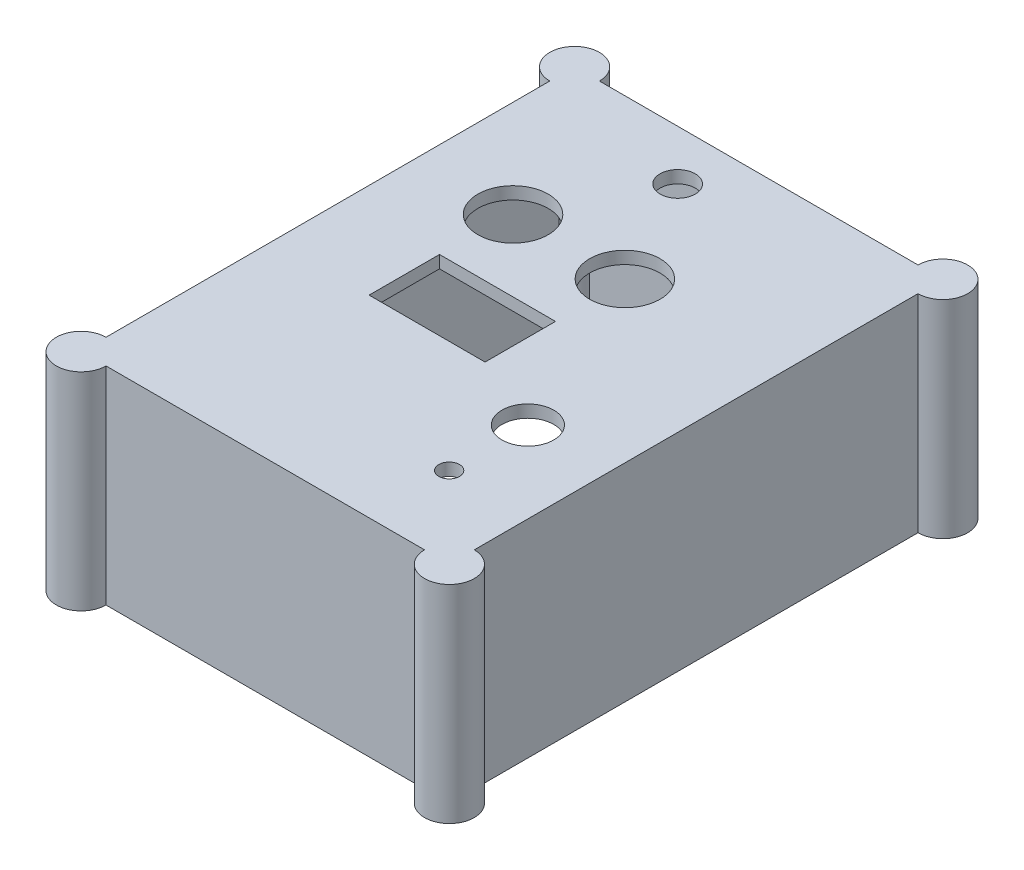
ISO-10303-21;
HEADER;
FILE_DESCRIPTION(('STEP AP214'),'2;1');
FILE_NAME('part.step','',(''),(''),'','','');
FILE_SCHEMA(('AUTOMOTIVE_DESIGN { 1 0 10303 214 1 1 1 1 }'));
ENDSEC;
DATA;
#1=APPLICATION_CONTEXT('core data for automotive mechanical design processes');
#2=APPLICATION_PROTOCOL_DEFINITION('international standard','automotive_design',2000,#1);
#3=PRODUCT_CONTEXT('',#1,'mechanical');
#4=PRODUCT('Part','Part','',(#3));
#5=PRODUCT_RELATED_PRODUCT_CATEGORY('part','',(#4));
#6=PRODUCT_DEFINITION_FORMATION('','',#4);
#7=PRODUCT_DEFINITION_CONTEXT('part definition',#1,'design');
#8=PRODUCT_DEFINITION('design','',#6,#7);
#9=PRODUCT_DEFINITION_SHAPE('','',#8);
#10=(LENGTH_UNIT() NAMED_UNIT(*) SI_UNIT(.MILLI.,.METRE.));
#11=(NAMED_UNIT(*) PLANE_ANGLE_UNIT() SI_UNIT($,.RADIAN.));
#12=(NAMED_UNIT(*) SI_UNIT($,.STERADIAN.) SOLID_ANGLE_UNIT());
#13=UNCERTAINTY_MEASURE_WITH_UNIT(LENGTH_MEASURE(1.E-05),#10,'distance_accuracy_value','');
#14=(GEOMETRIC_REPRESENTATION_CONTEXT(3) GLOBAL_UNCERTAINTY_ASSIGNED_CONTEXT((#13)) GLOBAL_UNIT_ASSIGNED_CONTEXT((#10,
#11,#12)) REPRESENTATION_CONTEXT('',''));
#15=CARTESIAN_POINT('',(0.,0.,0.));
#16=DIRECTION('',(0.,0.,1.));
#17=DIRECTION('',(1.,0.,0.));
#18=AXIS2_PLACEMENT_3D('',#15,#16,#17);
#19=CARTESIAN_POINT('',(0.,3.,0.));
#20=DIRECTION('',(0.,-1.,0.));
#21=DIRECTION('',(0.,0.,-1.));
#22=AXIS2_PLACEMENT_3D('',#19,#20,#21);
#23=PLANE('',#22);
#24=CARTESIAN_POINT('',(5.99999999999999,3.,-21.25));
#25=DIRECTION('',(0.,1.,0.));
#26=DIRECTION('',(0.,0.,-1.));
#27=AXIS2_PLACEMENT_3D('',#24,#25,#26);
#28=CIRCLE('',#27,8.5);
#29=CARTESIAN_POINT('',(5.99999999999999,3.,-29.75));
#30=VERTEX_POINT('',#29);
#31=EDGE_CURVE('E256',#30,#30,#28,.T.);
#32=ORIENTED_EDGE('',*,*,#31,.F.);
#33=EDGE_LOOP('',(#32));
#34=FACE_BOUND('',#33,.T.);
#35=CARTESIAN_POINT('',(-21.,3.,-21.25));
#36=DIRECTION('',(0.,1.,0.));
#37=DIRECTION('',(0.,0.,1.));
#38=AXIS2_PLACEMENT_3D('',#35,#36,#37);
#39=CIRCLE('',#38,8.5);
#40=CARTESIAN_POINT('',(-21.,3.,-12.75));
#41=VERTEX_POINT('',#40);
#42=EDGE_CURVE('E262',#41,#41,#39,.T.);
#43=ORIENTED_EDGE('',*,*,#42,.F.);
#44=EDGE_LOOP('',(#43));
#45=FACE_BOUND('',#44,.T.);
#46=CARTESIAN_POINT('',(-7.50000000000001,3.,-47.5));
#47=DIRECTION('',(0.,1.,0.));
#48=DIRECTION('',(0.,0.,1.));
#49=AXIS2_PLACEMENT_3D('',#46,#47,#48);
#50=CIRCLE('',#49,4.25);
#51=CARTESIAN_POINT('',(-7.50000000000001,3.,-43.25));
#52=VERTEX_POINT('',#51);
#53=EDGE_CURVE('E268',#52,#52,#50,.T.);
#54=ORIENTED_EDGE('',*,*,#53,.F.);
#55=EDGE_LOOP('',(#54));
#56=FACE_BOUND('',#55,.T.);
#57=DIRECTION('',(0.,0.,-1.));
#58=VECTOR('',#57,1.);
#59=CARTESIAN_POINT('',(6.5,3.,13.));
#60=LINE('',#59,#58);
#61=CARTESIAN_POINT('',(6.5,3.,13.));
#62=VERTEX_POINT('',#61);
#63=CARTESIAN_POINT('',(6.50000000000001,3.,-4.00000000000001));
#64=VERTEX_POINT('',#63);
#65=EDGE_CURVE('E225',#62,#64,#60,.T.);
#66=ORIENTED_EDGE('',*,*,#65,.F.);
#67=DIRECTION('',(1.,0.,0.));
#68=VECTOR('',#67,1.);
#69=CARTESIAN_POINT('',(-21.5,3.,13.));
#70=LINE('',#69,#68);
#71=CARTESIAN_POINT('',(-21.5,3.,13.));
#72=VERTEX_POINT('',#71);
#73=EDGE_CURVE('E233',#72,#62,#70,.T.);
#74=ORIENTED_EDGE('',*,*,#73,.F.);
#75=DIRECTION('',(0.,0.,1.));
#76=VECTOR('',#75,1.);
#77=CARTESIAN_POINT('',(-21.5,3.,13.));
#78=LINE('',#77,#76);
#79=CARTESIAN_POINT('',(-21.5,3.,-4.00000000000001));
#80=VERTEX_POINT('',#79);
#81=EDGE_CURVE('E230',#80,#72,#78,.T.);
#82=ORIENTED_EDGE('',*,*,#81,.F.);
#83=DIRECTION('',(-1.,0.,0.));
#84=VECTOR('',#83,1.);
#85=CARTESIAN_POINT('',(-21.5,3.,-4.00000000000001));
#86=LINE('',#85,#84);
#87=EDGE_CURVE('E227',#64,#80,#86,.T.);
#88=ORIENTED_EDGE('',*,*,#87,.F.);
#89=EDGE_LOOP('',(#66,#74,#82,#88));
#90=FACE_BOUND('',#89,.T.);
#91=CARTESIAN_POINT('',(24.8303027798234,3.,21.));
#92=DIRECTION('',(0.,1.,0.));
#93=DIRECTION('',(0.,0.,1.));
#94=AXIS2_PLACEMENT_3D('',#91,#92,#93);
#95=CIRCLE('',#94,6.25);
#96=CARTESIAN_POINT('',(24.8303027798234,3.,27.25));
#97=VERTEX_POINT('',#96);
#98=EDGE_CURVE('E219',#97,#97,#95,.T.);
#99=ORIENTED_EDGE('',*,*,#98,.F.);
#100=EDGE_LOOP('',(#99));
#101=FACE_BOUND('',#100,.T.);
#102=CARTESIAN_POINT('',(24.8303027798234,3.,40.));
#103=DIRECTION('',(0.,1.,0.));
#104=DIRECTION('',(0.,0.,1.));
#105=AXIS2_PLACEMENT_3D('',#102,#103,#104);
#106=CIRCLE('',#105,2.5);
#107=CARTESIAN_POINT('',(24.8303027798234,3.,42.5));
#108=VERTEX_POINT('',#107);
#109=EDGE_CURVE('E200',#108,#108,#106,.T.);
#110=ORIENTED_EDGE('',*,*,#109,.F.);
#111=EDGE_LOOP('',(#110));
#112=FACE_BOUND('',#111,.T.);
#113=DIRECTION('',(0.,0.,1.));
#114=VECTOR('',#113,1.);
#115=CARTESIAN_POINT('',(-44.4588537318775,3.,59.5709641012657));
#116=LINE('',#115,#114);
#117=CARTESIAN_POINT('',(-44.4588537318775,3.,-53.5709641012657));
#118=VERTEX_POINT('',#117);
#119=CARTESIAN_POINT('',(-44.4588537318775,3.,53.5709641012657));
#120=VERTEX_POINT('',#119);
#121=EDGE_CURVE('E211',#118,#120,#116,.T.);
#122=ORIENTED_EDGE('',*,*,#121,.T.);
#123=CARTESIAN_POINT('',(-44.4588537318775,3.,59.5709641012657));
#124=DIRECTION('',(0.,1.,0.));
#125=DIRECTION('',(0.,0.,1.));
#126=AXIS2_PLACEMENT_3D('',#123,#124,#125);
#127=CIRCLE('',#126,6.);
#128=CARTESIAN_POINT('',(-38.4588537318775,3.,59.5709641012657));
#129=VERTEX_POINT('',#128);
#130=EDGE_CURVE('E181',#120,#129,#127,.T.);
#131=ORIENTED_EDGE('',*,*,#130,.T.);
#132=DIRECTION('',(1.,0.,0.));
#133=VECTOR('',#132,1.);
#134=CARTESIAN_POINT('',(-44.4588537318775,3.,59.5709641012657));
#135=LINE('',#134,#133);
#136=CARTESIAN_POINT('',(38.4588537318775,3.,59.5709641012657));
#137=VERTEX_POINT('',#136);
#138=EDGE_CURVE('E189',#129,#137,#135,.T.);
#139=ORIENTED_EDGE('',*,*,#138,.T.);
#140=CARTESIAN_POINT('',(44.4588537318775,3.,59.5709641012657));
#141=DIRECTION('',(0.,1.,0.));
#142=DIRECTION('',(0.,0.,1.));
#143=AXIS2_PLACEMENT_3D('',#140,#141,#142);
#144=CIRCLE('',#143,6.);
#145=CARTESIAN_POINT('',(44.4588537318775,3.,53.5709641012657));
#146=VERTEX_POINT('',#145);
#147=EDGE_CURVE('E190',#137,#146,#144,.T.);
#148=ORIENTED_EDGE('',*,*,#147,.T.);
#149=DIRECTION('',(0.,0.,-1.));
#150=VECTOR('',#149,1.);
#151=CARTESIAN_POINT('',(44.4588537318775,3.,59.5709641012657));
#152=LINE('',#151,#150);
#153=CARTESIAN_POINT('',(44.4588537318775,3.,-53.5709641012657));
#154=VERTEX_POINT('',#153);
#155=EDGE_CURVE('E206',#146,#154,#152,.T.);
#156=ORIENTED_EDGE('',*,*,#155,.T.);
#157=CARTESIAN_POINT('',(44.4588537318775,3.,-59.5709641012657));
#158=DIRECTION('',(0.,1.,0.));
#159=DIRECTION('',(0.,0.,1.));
#160=AXIS2_PLACEMENT_3D('',#157,#158,#159);
#161=CIRCLE('',#160,6.);
#162=CARTESIAN_POINT('',(38.4588537318775,3.,-59.5709641012657));
#163=VERTEX_POINT('',#162);
#164=EDGE_CURVE('E56',#154,#163,#161,.T.);
#165=ORIENTED_EDGE('',*,*,#164,.T.);
#166=DIRECTION('',(-1.,0.,0.));
#167=VECTOR('',#166,1.);
#168=CARTESIAN_POINT('',(-44.4588537318775,3.,-59.5709641012657));
#169=LINE('',#168,#167);
#170=CARTESIAN_POINT('',(-38.4588537318775,3.,-59.5709641012657));
#171=VERTEX_POINT('',#170);
#172=EDGE_CURVE('E208',#163,#171,#169,.T.);
#173=ORIENTED_EDGE('',*,*,#172,.T.);
#174=CARTESIAN_POINT('',(-44.4588537318775,3.,-59.5709641012657));
#175=DIRECTION('',(0.,1.,0.));
#176=DIRECTION('',(0.,0.,1.));
#177=AXIS2_PLACEMENT_3D('',#174,#175,#176);
#178=CIRCLE('',#177,6.);
#179=EDGE_CURVE('E318',#171,#118,#178,.T.);
#180=ORIENTED_EDGE('',*,*,#179,.T.);
#181=EDGE_LOOP('',(#122,#131,#139,#148,#156,#165,#173,#180));
#182=FACE_BOUND('',#181,.T.);
#183=ADVANCED_FACE('F33',(#34,#45,#56,#90,#101,#112,#182),#23,.F.);
#184=CARTESIAN_POINT('',(0.,0.,0.));
#185=DIRECTION('',(0.,-1.,0.));
#186=DIRECTION('',(0.,0.,-1.));
#187=AXIS2_PLACEMENT_3D('',#184,#185,#186);
#188=PLANE('',#187);
#189=CARTESIAN_POINT('',(-44.4588537318775,0.,59.5709641012657));
#190=DIRECTION('',(0.,-1.,0.));
#191=DIRECTION('',(0.,0.,-1.));
#192=AXIS2_PLACEMENT_3D('',#189,#190,#191);
#193=CIRCLE('',#192,6.);
#194=CARTESIAN_POINT('',(-42.5,0.,53.8997303680195));
#195=VERTEX_POINT('',#194);
#196=CARTESIAN_POINT('',(-38.8275920889355,0.,57.5));
#197=VERTEX_POINT('',#196);
#198=EDGE_CURVE('E378',#195,#197,#193,.T.);
#199=ORIENTED_EDGE('',*,*,#198,.F.);
#200=DIRECTION('',(0.,0.,1.));
#201=VECTOR('',#200,1.);
#202=CARTESIAN_POINT('',(-42.5,0.,57.5));
#203=LINE('',#202,#201);
#204=CARTESIAN_POINT('',(-42.5,0.,-53.8997303680195));
#205=VERTEX_POINT('',#204);
#206=EDGE_CURVE('E278',#205,#195,#203,.T.);
#207=ORIENTED_EDGE('',*,*,#206,.F.);
#208=CARTESIAN_POINT('',(-44.4588537318775,0.,-59.5709641012657));
#209=DIRECTION('',(0.,-1.,0.));
#210=DIRECTION('',(0.,0.,-1.));
#211=AXIS2_PLACEMENT_3D('',#208,#209,#210);
#212=CIRCLE('',#211,6.);
#213=CARTESIAN_POINT('',(-38.8275920889355,0.,-57.5));
#214=VERTEX_POINT('',#213);
#215=EDGE_CURVE('E324',#214,#205,#212,.T.);
#216=ORIENTED_EDGE('',*,*,#215,.F.);
#217=DIRECTION('',(-1.,0.,0.));
#218=VECTOR('',#217,1.);
#219=CARTESIAN_POINT('',(-42.5,0.,-57.5));
#220=LINE('',#219,#218);
#221=CARTESIAN_POINT('',(38.8275920889355,0.,-57.5));
#222=VERTEX_POINT('',#221);
#223=EDGE_CURVE('E275',#222,#214,#220,.T.);
#224=ORIENTED_EDGE('',*,*,#223,.F.);
#225=CARTESIAN_POINT('',(44.4588537318775,0.,-59.5709641012657));
#226=DIRECTION('',(0.,-1.,0.));
#227=DIRECTION('',(0.,0.,-1.));
#228=AXIS2_PLACEMENT_3D('',#225,#226,#227);
#229=CIRCLE('',#228,6.);
#230=CARTESIAN_POINT('',(42.5,0.,-53.8997303680195));
#231=VERTEX_POINT('',#230);
#232=EDGE_CURVE('E335',#231,#222,#229,.T.);
#233=ORIENTED_EDGE('',*,*,#232,.F.);
#234=DIRECTION('',(0.,0.,-1.));
#235=VECTOR('',#234,1.);
#236=CARTESIAN_POINT('',(42.5,0.,57.5));
#237=LINE('',#236,#235);
#238=CARTESIAN_POINT('',(42.5,0.,53.8997303680195));
#239=VERTEX_POINT('',#238);
#240=EDGE_CURVE('E271',#239,#231,#237,.T.);
#241=ORIENTED_EDGE('',*,*,#240,.F.);
#242=CARTESIAN_POINT('',(44.4588537318775,0.,59.5709641012657));
#243=DIRECTION('',(0.,-1.,0.));
#244=DIRECTION('',(0.,0.,-1.));
#245=AXIS2_PLACEMENT_3D('',#242,#243,#244);
#246=CIRCLE('',#245,6.);
#247=CARTESIAN_POINT('',(38.8275920889355,0.,57.5));
#248=VERTEX_POINT('',#247);
#249=EDGE_CURVE('E299',#248,#239,#246,.T.);
#250=ORIENTED_EDGE('',*,*,#249,.F.);
#251=DIRECTION('',(1.,0.,0.));
#252=VECTOR('',#251,1.);
#253=CARTESIAN_POINT('',(-42.5,0.,57.5));
#254=LINE('',#253,#252);
#255=EDGE_CURVE('E281',#197,#248,#254,.T.);
#256=ORIENTED_EDGE('',*,*,#255,.F.);
#257=EDGE_LOOP('',(#199,#207,#216,#224,#233,#241,#250,#256));
#258=FACE_BOUND('',#257,.T.);
#259=CARTESIAN_POINT('',(24.8303027798234,0.,21.));
#260=DIRECTION('',(0.,1.,0.));
#261=DIRECTION('',(0.,0.,1.));
#262=AXIS2_PLACEMENT_3D('',#259,#260,#261);
#263=CIRCLE('',#262,6.25);
#264=CARTESIAN_POINT('',(24.8303027798234,0.,27.25));
#265=VERTEX_POINT('',#264);
#266=EDGE_CURVE('E217',#265,#265,#263,.T.);
#267=ORIENTED_EDGE('',*,*,#266,.T.);
#268=EDGE_LOOP('',(#267));
#269=FACE_BOUND('',#268,.T.);
#270=CARTESIAN_POINT('',(-21.,0.,-21.25));
#271=DIRECTION('',(0.,1.,0.));
#272=DIRECTION('',(0.,0.,1.));
#273=AXIS2_PLACEMENT_3D('',#270,#271,#272);
#274=CIRCLE('',#273,8.5);
#275=CARTESIAN_POINT('',(-21.,0.,-12.75));
#276=VERTEX_POINT('',#275);
#277=EDGE_CURVE('E259',#276,#276,#274,.T.);
#278=ORIENTED_EDGE('',*,*,#277,.T.);
#279=EDGE_LOOP('',(#278));
#280=FACE_BOUND('',#279,.T.);
#281=CARTESIAN_POINT('',(-7.50000000000001,0.,-47.5));
#282=DIRECTION('',(0.,1.,0.));
#283=DIRECTION('',(0.,0.,1.));
#284=AXIS2_PLACEMENT_3D('',#281,#282,#283);
#285=CIRCLE('',#284,4.25);
#286=CARTESIAN_POINT('',(-7.50000000000001,0.,-43.25));
#287=VERTEX_POINT('',#286);
#288=EDGE_CURVE('E265',#287,#287,#285,.T.);
#289=ORIENTED_EDGE('',*,*,#288,.T.);
#290=EDGE_LOOP('',(#289));
#291=FACE_BOUND('',#290,.T.);
#292=CARTESIAN_POINT('',(5.99999999999999,0.,-21.25));
#293=DIRECTION('',(0.,1.,0.));
#294=DIRECTION('',(0.,0.,-1.));
#295=AXIS2_PLACEMENT_3D('',#292,#293,#294);
#296=CIRCLE('',#295,8.5);
#297=CARTESIAN_POINT('',(5.99999999999999,0.,-29.75));
#298=VERTEX_POINT('',#297);
#299=EDGE_CURVE('E255',#298,#298,#296,.T.);
#300=ORIENTED_EDGE('',*,*,#299,.T.);
#301=EDGE_LOOP('',(#300));
#302=FACE_BOUND('',#301,.T.);
#303=DIRECTION('',(1.,0.,0.));
#304=VECTOR('',#303,1.);
#305=CARTESIAN_POINT('',(-21.5,0.,13.));
#306=LINE('',#305,#304);
#307=CARTESIAN_POINT('',(-21.5,0.,13.));
#308=VERTEX_POINT('',#307);
#309=CARTESIAN_POINT('',(6.5,0.,13.));
#310=VERTEX_POINT('',#309);
#311=EDGE_CURVE('E228',#308,#310,#306,.T.);
#312=ORIENTED_EDGE('',*,*,#311,.T.);
#313=DIRECTION('',(0.,0.,-1.));
#314=VECTOR('',#313,1.);
#315=CARTESIAN_POINT('',(6.5,0.,13.));
#316=LINE('',#315,#314);
#317=CARTESIAN_POINT('',(6.50000000000001,0.,-4.00000000000001));
#318=VERTEX_POINT('',#317);
#319=EDGE_CURVE('E222',#310,#318,#316,.T.);
#320=ORIENTED_EDGE('',*,*,#319,.T.);
#321=DIRECTION('',(-1.,0.,0.));
#322=VECTOR('',#321,1.);
#323=CARTESIAN_POINT('',(-21.5,0.,-4.00000000000001));
#324=LINE('',#323,#322);
#325=CARTESIAN_POINT('',(-21.5,0.,-4.00000000000001));
#326=VERTEX_POINT('',#325);
#327=EDGE_CURVE('E238',#318,#326,#324,.T.);
#328=ORIENTED_EDGE('',*,*,#327,.T.);
#329=DIRECTION('',(0.,0.,1.));
#330=VECTOR('',#329,1.);
#331=CARTESIAN_POINT('',(-21.5,0.,13.));
#332=LINE('',#331,#330);
#333=EDGE_CURVE('E241',#326,#308,#332,.T.);
#334=ORIENTED_EDGE('',*,*,#333,.T.);
#335=EDGE_LOOP('',(#312,#320,#328,#334));
#336=FACE_BOUND('',#335,.T.);
#337=CARTESIAN_POINT('',(24.8303027798234,0.,40.));
#338=DIRECTION('',(0.,1.,0.));
#339=DIRECTION('',(0.,0.,1.));
#340=AXIS2_PLACEMENT_3D('',#337,#338,#339);
#341=CIRCLE('',#340,2.5);
#342=CARTESIAN_POINT('',(24.8303027798234,0.,42.5));
#343=VERTEX_POINT('',#342);
#344=EDGE_CURVE('E196',#343,#343,#341,.T.);
#345=ORIENTED_EDGE('',*,*,#344,.T.);
#346=EDGE_LOOP('',(#345));
#347=FACE_BOUND('',#346,.T.);
#348=ADVANCED_FACE('F35',(#258,#269,#280,#291,#302,#336,#347),#188,.T.);
#349=CARTESIAN_POINT('',(-7.50000000000001,3.,-47.5));
#350=DIRECTION('',(0.,-1.,0.));
#351=DIRECTION('',(0.,0.,-1.));
#352=AXIS2_PLACEMENT_3D('',#349,#350,#351);
#353=CYLINDRICAL_SURFACE('',#352,4.25);
#354=ORIENTED_EDGE('',*,*,#53,.T.);
#355=EDGE_LOOP('',(#354));
#356=FACE_BOUND('',#355,.T.);
#357=ORIENTED_EDGE('',*,*,#288,.F.);
#358=EDGE_LOOP('',(#357));
#359=FACE_BOUND('',#358,.T.);
#360=ADVANCED_FACE('F408',(#356,#359),#353,.F.);
#361=CARTESIAN_POINT('',(-21.,3.,-21.25));
#362=DIRECTION('',(0.,-1.,0.));
#363=DIRECTION('',(0.,0.,-1.));
#364=AXIS2_PLACEMENT_3D('',#361,#362,#363);
#365=CYLINDRICAL_SURFACE('',#364,8.5);
#366=ORIENTED_EDGE('',*,*,#42,.T.);
#367=EDGE_LOOP('',(#366));
#368=FACE_BOUND('',#367,.T.);
#369=ORIENTED_EDGE('',*,*,#277,.F.);
#370=EDGE_LOOP('',(#369));
#371=FACE_BOUND('',#370,.T.);
#372=ADVANCED_FACE('F414',(#368,#371),#365,.F.);
#373=CARTESIAN_POINT('',(5.99999999999999,3.,-21.25));
#374=DIRECTION('',(0.,-1.,0.));
#375=DIRECTION('',(0.,0.,-1.));
#376=AXIS2_PLACEMENT_3D('',#373,#374,#375);
#377=CYLINDRICAL_SURFACE('',#376,8.5);
#378=ORIENTED_EDGE('',*,*,#31,.T.);
#379=EDGE_LOOP('',(#378));
#380=FACE_BOUND('',#379,.T.);
#381=ORIENTED_EDGE('',*,*,#299,.F.);
#382=EDGE_LOOP('',(#381));
#383=FACE_BOUND('',#382,.T.);
#384=ADVANCED_FACE('F418',(#380,#383),#377,.F.);
#385=CARTESIAN_POINT('',(6.5,3.,13.));
#386=DIRECTION('',(-1.,0.,0.));
#387=DIRECTION('',(0.,0.,1.));
#388=AXIS2_PLACEMENT_3D('',#385,#386,#387);
#389=PLANE('',#388);
#390=ORIENTED_EDGE('',*,*,#319,.F.);
#391=DIRECTION('',(0.,-1.,0.));
#392=VECTOR('',#391,1.);
#393=CARTESIAN_POINT('',(6.5,3.,13.));
#394=LINE('',#393,#392);
#395=EDGE_CURVE('E235',#62,#310,#394,.T.);
#396=ORIENTED_EDGE('',*,*,#395,.F.);
#397=ORIENTED_EDGE('',*,*,#65,.T.);
#398=DIRECTION('',(0.,-1.,0.));
#399=VECTOR('',#398,1.);
#400=CARTESIAN_POINT('',(6.50000000000001,3.,-4.00000000000001));
#401=LINE('',#400,#399);
#402=EDGE_CURVE('E252',#64,#318,#401,.T.);
#403=ORIENTED_EDGE('',*,*,#402,.T.);
#404=EDGE_LOOP('',(#390,#396,#397,#403));
#405=FACE_BOUND('',#404,.T.);
#406=ADVANCED_FACE('F422',(#405),#389,.T.);
#407=CARTESIAN_POINT('',(-21.5,3.,-4.00000000000001));
#408=DIRECTION('',(0.,0.,1.));
#409=DIRECTION('',(1.,0.,0.));
#410=AXIS2_PLACEMENT_3D('',#407,#408,#409);
#411=PLANE('',#410);
#412=ORIENTED_EDGE('',*,*,#327,.F.);
#413=ORIENTED_EDGE('',*,*,#402,.F.);
#414=ORIENTED_EDGE('',*,*,#87,.T.);
#415=DIRECTION('',(0.,-1.,0.));
#416=VECTOR('',#415,1.);
#417=CARTESIAN_POINT('',(-21.5,3.,-4.00000000000001));
#418=LINE('',#417,#416);
#419=EDGE_CURVE('E250',#80,#326,#418,.T.);
#420=ORIENTED_EDGE('',*,*,#419,.T.);
#421=EDGE_LOOP('',(#412,#413,#414,#420));
#422=FACE_BOUND('',#421,.T.);
#423=ADVANCED_FACE('F426',(#422),#411,.T.);
#424=CARTESIAN_POINT('',(-21.5,3.,13.));
#425=DIRECTION('',(1.,0.,0.));
#426=DIRECTION('',(0.,0.,-1.));
#427=AXIS2_PLACEMENT_3D('',#424,#425,#426);
#428=PLANE('',#427);
#429=ORIENTED_EDGE('',*,*,#333,.F.);
#430=ORIENTED_EDGE('',*,*,#419,.F.);
#431=ORIENTED_EDGE('',*,*,#81,.T.);
#432=DIRECTION('',(0.,-1.,0.));
#433=VECTOR('',#432,1.);
#434=CARTESIAN_POINT('',(-21.5,3.,13.));
#435=LINE('',#434,#433);
#436=EDGE_CURVE('E248',#72,#308,#435,.T.);
#437=ORIENTED_EDGE('',*,*,#436,.T.);
#438=EDGE_LOOP('',(#429,#430,#431,#437));
#439=FACE_BOUND('',#438,.T.);
#440=ADVANCED_FACE('F430',(#439),#428,.T.);
#441=CARTESIAN_POINT('',(-21.5,3.,13.));
#442=DIRECTION('',(0.,0.,-1.));
#443=DIRECTION('',(-1.,0.,0.));
#444=AXIS2_PLACEMENT_3D('',#441,#442,#443);
#445=PLANE('',#444);
#446=ORIENTED_EDGE('',*,*,#311,.F.);
#447=ORIENTED_EDGE('',*,*,#436,.F.);
#448=ORIENTED_EDGE('',*,*,#73,.T.);
#449=ORIENTED_EDGE('',*,*,#395,.T.);
#450=EDGE_LOOP('',(#446,#447,#448,#449));
#451=FACE_BOUND('',#450,.T.);
#452=ADVANCED_FACE('F434',(#451),#445,.T.);
#453=CARTESIAN_POINT('',(24.8303027798234,3.,21.));
#454=DIRECTION('',(0.,-1.,0.));
#455=DIRECTION('',(0.,0.,-1.));
#456=AXIS2_PLACEMENT_3D('',#453,#454,#455);
#457=CYLINDRICAL_SURFACE('',#456,6.25);
#458=ORIENTED_EDGE('',*,*,#98,.T.);
#459=EDGE_LOOP('',(#458));
#460=FACE_BOUND('',#459,.T.);
#461=ORIENTED_EDGE('',*,*,#266,.F.);
#462=EDGE_LOOP('',(#461));
#463=FACE_BOUND('',#462,.T.);
#464=ADVANCED_FACE('F438',(#460,#463),#457,.F.);
#465=CARTESIAN_POINT('',(24.8303027798234,3.,40.));
#466=DIRECTION('',(0.,-1.,0.));
#467=DIRECTION('',(0.,0.,-1.));
#468=AXIS2_PLACEMENT_3D('',#465,#466,#467);
#469=CYLINDRICAL_SURFACE('',#468,2.5);
#470=ORIENTED_EDGE('',*,*,#109,.T.);
#471=EDGE_LOOP('',(#470));
#472=FACE_BOUND('',#471,.T.);
#473=ORIENTED_EDGE('',*,*,#344,.F.);
#474=EDGE_LOOP('',(#473));
#475=FACE_BOUND('',#474,.T.);
#476=ADVANCED_FACE('F442',(#472,#475),#469,.F.);
#477=CARTESIAN_POINT('',(44.4588537318775,-47.,59.5709641012657));
#478=DIRECTION('',(1.,0.,0.));
#479=DIRECTION('',(0.,0.,-1.));
#480=AXIS2_PLACEMENT_3D('',#477,#478,#479);
#481=PLANE('',#480);
#482=DIRECTION('',(0.,1.,0.));
#483=VECTOR('',#482,1.);
#484=CARTESIAN_POINT('',(44.4588537318775,-47.,53.5709641012657));
#485=LINE('',#484,#483);
#486=CARTESIAN_POINT('',(44.4588537318775,-47.,53.5709641012657));
#487=VERTEX_POINT('',#486);
#488=EDGE_CURVE('E316',#487,#146,#485,.T.);
#489=ORIENTED_EDGE('',*,*,#488,.F.);
#490=DIRECTION('',(0.,0.,-1.));
#491=VECTOR('',#490,1.);
#492=CARTESIAN_POINT('',(44.4588537318775,-47.,59.5709641012657));
#493=LINE('',#492,#491);
#494=CARTESIAN_POINT('',(44.4588537318775,-47.,-53.5709641012657));
#495=VERTEX_POINT('',#494);
#496=EDGE_CURVE('E215',#487,#495,#493,.T.);
#497=ORIENTED_EDGE('',*,*,#496,.T.);
#498=DIRECTION('',(0.,1.,0.));
#499=VECTOR('',#498,1.);
#500=CARTESIAN_POINT('',(44.4588537318775,-47.,-53.5709641012657));
#501=LINE('',#500,#499);
#502=EDGE_CURVE('E344',#154,#495,#501,.F.);
#503=ORIENTED_EDGE('',*,*,#502,.F.);
#504=ORIENTED_EDGE('',*,*,#155,.F.);
#505=EDGE_LOOP('',(#489,#497,#503,#504));
#506=FACE_BOUND('',#505,.T.);
#507=ADVANCED_FACE('F388',(#506),#481,.T.);
#508=CARTESIAN_POINT('',(-44.4588537318775,-47.,59.5709641012657));
#509=DIRECTION('',(0.,0.,1.));
#510=DIRECTION('',(1.,0.,0.));
#511=AXIS2_PLACEMENT_3D('',#508,#509,#510);
#512=PLANE('',#511);
#513=DIRECTION('',(0.,1.,0.));
#514=VECTOR('',#513,1.);
#515=CARTESIAN_POINT('',(-38.4588537318775,-47.,59.5709641012657));
#516=LINE('',#515,#514);
#517=CARTESIAN_POINT('',(-38.4588537318775,-47.,59.5709641012657));
#518=VERTEX_POINT('',#517);
#519=EDGE_CURVE('E173',#518,#129,#516,.T.);
#520=ORIENTED_EDGE('',*,*,#519,.F.);
#521=DIRECTION('',(1.,0.,0.));
#522=VECTOR('',#521,1.);
#523=CARTESIAN_POINT('',(-44.4588537318775,-47.,59.5709641012657));
#524=LINE('',#523,#522);
#525=CARTESIAN_POINT('',(38.4588537318775,-47.,59.5709641012657));
#526=VERTEX_POINT('',#525);
#527=EDGE_CURVE('E187',#518,#526,#524,.T.);
#528=ORIENTED_EDGE('',*,*,#527,.T.);
#529=DIRECTION('',(0.,1.,0.));
#530=VECTOR('',#529,1.);
#531=CARTESIAN_POINT('',(38.4588537318775,-47.,59.5709641012657));
#532=LINE('',#531,#530);
#533=EDGE_CURVE('E310',#137,#526,#532,.F.);
#534=ORIENTED_EDGE('',*,*,#533,.F.);
#535=ORIENTED_EDGE('',*,*,#138,.F.);
#536=EDGE_LOOP('',(#520,#528,#534,#535));
#537=FACE_BOUND('',#536,.T.);
#538=ADVANCED_FACE('F185',(#537),#512,.T.);
#539=CARTESIAN_POINT('',(-44.4588537318775,-47.,59.5709641012657));
#540=DIRECTION('',(-1.,0.,0.));
#541=DIRECTION('',(0.,0.,1.));
#542=AXIS2_PLACEMENT_3D('',#539,#540,#541);
#543=PLANE('',#542);
#544=DIRECTION('',(0.,1.,0.));
#545=VECTOR('',#544,1.);
#546=CARTESIAN_POINT('',(-44.4588537318775,-47.,53.5709641012657));
#547=LINE('',#546,#545);
#548=CARTESIAN_POINT('',(-44.4588537318775,-47.,53.5709641012657));
#549=VERTEX_POINT('',#548);
#550=EDGE_CURVE('E176',#120,#549,#547,.F.);
#551=ORIENTED_EDGE('',*,*,#550,.F.);
#552=ORIENTED_EDGE('',*,*,#121,.F.);
#553=DIRECTION('',(0.,1.,0.));
#554=VECTOR('',#553,1.);
#555=CARTESIAN_POINT('',(-44.4588537318775,-47.,-53.5709641012657));
#556=LINE('',#555,#554);
#557=CARTESIAN_POINT('',(-44.4588537318775,-47.,-53.5709641012657));
#558=VERTEX_POINT('',#557);
#559=EDGE_CURVE('E331',#558,#118,#556,.T.);
#560=ORIENTED_EDGE('',*,*,#559,.F.);
#561=DIRECTION('',(0.,0.,1.));
#562=VECTOR('',#561,1.);
#563=CARTESIAN_POINT('',(-44.4588537318775,-47.,59.5709641012657));
#564=LINE('',#563,#562);
#565=EDGE_CURVE('E197',#558,#549,#564,.T.);
#566=ORIENTED_EDGE('',*,*,#565,.T.);
#567=EDGE_LOOP('',(#551,#552,#560,#566));
#568=FACE_BOUND('',#567,.T.);
#569=ADVANCED_FACE('F368',(#568),#543,.T.);
#570=CARTESIAN_POINT('',(-44.4588537318775,-47.,-59.5709641012657));
#571=DIRECTION('',(0.,0.,-1.));
#572=DIRECTION('',(-1.,0.,0.));
#573=AXIS2_PLACEMENT_3D('',#570,#571,#572);
#574=PLANE('',#573);
#575=DIRECTION('',(0.,1.,0.));
#576=VECTOR('',#575,1.);
#577=CARTESIAN_POINT('',(-38.4588537318775,-47.,-59.5709641012657));
#578=LINE('',#577,#576);
#579=CARTESIAN_POINT('',(-38.4588537318775,-47.,-59.5709641012657));
#580=VERTEX_POINT('',#579);
#581=EDGE_CURVE('E329',#171,#580,#578,.F.);
#582=ORIENTED_EDGE('',*,*,#581,.F.);
#583=ORIENTED_EDGE('',*,*,#172,.F.);
#584=DIRECTION('',(0.,1.,0.));
#585=VECTOR('',#584,1.);
#586=CARTESIAN_POINT('',(38.4588537318775,-47.,-59.5709641012657));
#587=LINE('',#586,#585);
#588=CARTESIAN_POINT('',(38.4588537318775,-47.,-59.5709641012657));
#589=VERTEX_POINT('',#588);
#590=EDGE_CURVE('E342',#589,#163,#587,.T.);
#591=ORIENTED_EDGE('',*,*,#590,.F.);
#592=DIRECTION('',(-1.,0.,0.));
#593=VECTOR('',#592,1.);
#594=CARTESIAN_POINT('',(-44.4588537318775,-47.,-59.5709641012657));
#595=LINE('',#594,#593);
#596=EDGE_CURVE('E202',#589,#580,#595,.T.);
#597=ORIENTED_EDGE('',*,*,#596,.T.);
#598=EDGE_LOOP('',(#582,#583,#591,#597));
#599=FACE_BOUND('',#598,.T.);
#600=ADVANCED_FACE('F359',(#599),#574,.T.);
#601=CARTESIAN_POINT('',(0.,-47.,0.));
#602=DIRECTION('',(0.,-1.,0.));
#603=DIRECTION('',(0.,0.,-1.));
#604=AXIS2_PLACEMENT_3D('',#601,#602,#603);
#605=PLANE('',#604);
#606=CARTESIAN_POINT('',(-44.4588537318775,-47.,-59.5709641012657));
#607=DIRECTION('',(0.,-1.,0.));
#608=DIRECTION('',(0.,0.,-1.));
#609=AXIS2_PLACEMENT_3D('',#606,#607,#608);
#610=CIRCLE('',#609,1.6);
#611=CARTESIAN_POINT('',(-44.4588537318775,-47.,-61.1709641012657));
#612=VERTEX_POINT('',#611);
#613=EDGE_CURVE('E608',#612,#612,#610,.T.);
#614=ORIENTED_EDGE('',*,*,#613,.F.);
#615=EDGE_LOOP('',(#614));
#616=FACE_BOUND('',#615,.T.);
#617=CARTESIAN_POINT('',(44.4588537318775,-47.,-59.5709641012657));
#618=DIRECTION('',(0.,-1.,0.));
#619=DIRECTION('',(0.,0.,-1.));
#620=AXIS2_PLACEMENT_3D('',#617,#618,#619);
#621=CIRCLE('',#620,1.6);
#622=CARTESIAN_POINT('',(44.4588537318775,-47.,-61.1709641012657));
#623=VERTEX_POINT('',#622);
#624=EDGE_CURVE('E607',#623,#623,#621,.T.);
#625=ORIENTED_EDGE('',*,*,#624,.F.);
#626=EDGE_LOOP('',(#625));
#627=FACE_BOUND('',#626,.T.);
#628=CARTESIAN_POINT('',(44.4588537318775,-47.,59.5709641012657));
#629=DIRECTION('',(0.,-1.,0.));
#630=DIRECTION('',(0.,0.,-1.));
#631=AXIS2_PLACEMENT_3D('',#628,#629,#630);
#632=CIRCLE('',#631,1.6);
#633=CARTESIAN_POINT('',(44.4588537318775,-47.,57.9709641012657));
#634=VERTEX_POINT('',#633);
#635=EDGE_CURVE('E621',#634,#634,#632,.T.);
#636=ORIENTED_EDGE('',*,*,#635,.F.);
#637=EDGE_LOOP('',(#636));
#638=FACE_BOUND('',#637,.T.);
#639=CARTESIAN_POINT('',(-44.4588537318775,-47.,59.5709641012657));
#640=DIRECTION('',(0.,-1.,0.));
#641=DIRECTION('',(0.,0.,-1.));
#642=AXIS2_PLACEMENT_3D('',#639,#640,#641);
#643=CIRCLE('',#642,1.6);
#644=CARTESIAN_POINT('',(-44.4588537318775,-47.,57.9709641012657));
#645=VERTEX_POINT('',#644);
#646=EDGE_CURVE('E374',#645,#645,#643,.T.);
#647=ORIENTED_EDGE('',*,*,#646,.F.);
#648=EDGE_LOOP('',(#647));
#649=FACE_BOUND('',#648,.T.);
#650=ORIENTED_EDGE('',*,*,#527,.F.);
#651=CARTESIAN_POINT('',(-44.4588537318775,-47.,59.5709641012657));
#652=DIRECTION('',(0.,1.,0.));
#653=DIRECTION('',(0.,0.,1.));
#654=AXIS2_PLACEMENT_3D('',#651,#652,#653);
#655=CIRCLE('',#654,6.);
#656=EDGE_CURVE('E170',#549,#518,#655,.T.);
#657=ORIENTED_EDGE('',*,*,#656,.F.);
#658=ORIENTED_EDGE('',*,*,#565,.F.);
#659=CARTESIAN_POINT('',(-44.4588537318775,-47.,-59.5709641012657));
#660=DIRECTION('',(0.,1.,0.));
#661=DIRECTION('',(0.,0.,1.));
#662=AXIS2_PLACEMENT_3D('',#659,#660,#661);
#663=CIRCLE('',#662,6.);
#664=EDGE_CURVE('E319',#580,#558,#663,.T.);
#665=ORIENTED_EDGE('',*,*,#664,.F.);
#666=ORIENTED_EDGE('',*,*,#596,.F.);
#667=CARTESIAN_POINT('',(44.4588537318775,-47.,-59.5709641012657));
#668=DIRECTION('',(0.,1.,0.));
#669=DIRECTION('',(0.,0.,1.));
#670=AXIS2_PLACEMENT_3D('',#667,#668,#669);
#671=CIRCLE('',#670,6.);
#672=EDGE_CURVE('E333',#495,#589,#671,.T.);
#673=ORIENTED_EDGE('',*,*,#672,.F.);
#674=ORIENTED_EDGE('',*,*,#496,.F.);
#675=CARTESIAN_POINT('',(44.4588537318775,-47.,59.5709641012657));
#676=DIRECTION('',(0.,1.,0.));
#677=DIRECTION('',(0.,0.,1.));
#678=AXIS2_PLACEMENT_3D('',#675,#676,#677);
#679=CIRCLE('',#678,6.);
#680=EDGE_CURVE('E195',#526,#487,#679,.T.);
#681=ORIENTED_EDGE('',*,*,#680,.F.);
#682=EDGE_LOOP('',(#650,#657,#658,#665,#666,#673,#674,#681));
#683=FACE_BOUND('',#682,.T.);
#684=DIRECTION('',(0.,0.,1.));
#685=VECTOR('',#684,1.);
#686=CARTESIAN_POINT('',(-42.5,-47.,57.5));
#687=LINE('',#686,#685);
#688=CARTESIAN_POINT('',(-42.5,-47.,-53.8997303680195));
#689=VERTEX_POINT('',#688);
#690=CARTESIAN_POINT('',(-42.5,-47.,53.8997303680195));
#691=VERTEX_POINT('',#690);
#692=EDGE_CURVE('E347',#689,#691,#687,.T.);
#693=ORIENTED_EDGE('',*,*,#692,.T.);
#694=CARTESIAN_POINT('',(-38.8275920889355,-47.,57.5));
#695=VERTEX_POINT('',#694);
#696=EDGE_CURVE('E48',#695,#691,#655,.T.);
#697=ORIENTED_EDGE('',*,*,#696,.F.);
#698=DIRECTION('',(1.,0.,0.));
#699=VECTOR('',#698,1.);
#700=CARTESIAN_POINT('',(42.5,-47.,57.5));
#701=LINE('',#700,#699);
#702=CARTESIAN_POINT('',(38.8275920889355,-47.,57.5));
#703=VERTEX_POINT('',#702);
#704=EDGE_CURVE('E293',#695,#703,#701,.T.);
#705=ORIENTED_EDGE('',*,*,#704,.T.);
#706=CARTESIAN_POINT('',(42.5,-47.,53.8997303680195));
#707=VERTEX_POINT('',#706);
#708=EDGE_CURVE('E302',#707,#703,#679,.T.);
#709=ORIENTED_EDGE('',*,*,#708,.F.);
#710=DIRECTION('',(0.,0.,-1.));
#711=VECTOR('',#710,1.);
#712=CARTESIAN_POINT('',(42.5,-47.,-57.5));
#713=LINE('',#712,#711);
#714=CARTESIAN_POINT('',(42.5,-47.,-53.8997303680195));
#715=VERTEX_POINT('',#714);
#716=EDGE_CURVE('E350',#707,#715,#713,.T.);
#717=ORIENTED_EDGE('',*,*,#716,.T.);
#718=CARTESIAN_POINT('',(38.8275920889355,-47.,-57.5));
#719=VERTEX_POINT('',#718);
#720=EDGE_CURVE('E336',#719,#715,#671,.T.);
#721=ORIENTED_EDGE('',*,*,#720,.F.);
#722=DIRECTION('',(-1.,0.,0.));
#723=VECTOR('',#722,1.);
#724=CARTESIAN_POINT('',(-42.5,-47.,-57.5));
#725=LINE('',#724,#723);
#726=CARTESIAN_POINT('',(-38.8275920889355,-47.,-57.5));
#727=VERTEX_POINT('',#726);
#728=EDGE_CURVE('E209',#719,#727,#725,.T.);
#729=ORIENTED_EDGE('',*,*,#728,.T.);
#730=EDGE_CURVE('E321',#689,#727,#663,.T.);
#731=ORIENTED_EDGE('',*,*,#730,.F.);
#732=EDGE_LOOP('',(#693,#697,#705,#709,#717,#721,#729,#731));
#733=FACE_BOUND('',#732,.T.);
#734=ADVANCED_FACE('F193',(#616,#627,#638,#649,#683,#733),#605,.T.);
#735=CARTESIAN_POINT('',(-42.5,-47.,57.5));
#736=DIRECTION('',(-1.,0.,0.));
#737=DIRECTION('',(0.,0.,1.));
#738=AXIS2_PLACEMENT_3D('',#735,#736,#737);
#739=PLANE('',#738);
#740=ORIENTED_EDGE('',*,*,#206,.T.);
#741=DIRECTION('',(0.,1.,0.));
#742=VECTOR('',#741,1.);
#743=CARTESIAN_POINT('',(-42.5,-47.,53.8997303680195));
#744=LINE('',#743,#742);
#745=EDGE_CURVE('E380',#195,#691,#744,.F.);
#746=ORIENTED_EDGE('',*,*,#745,.T.);
#747=ORIENTED_EDGE('',*,*,#692,.F.);
#748=DIRECTION('',(0.,1.,0.));
#749=VECTOR('',#748,1.);
#750=CARTESIAN_POINT('',(-42.5,-47.,-53.8997303680195));
#751=LINE('',#750,#749);
#752=EDGE_CURVE('E326',#689,#205,#751,.T.);
#753=ORIENTED_EDGE('',*,*,#752,.T.);
#754=EDGE_LOOP('',(#740,#746,#747,#753));
#755=FACE_BOUND('',#754,.T.);
#756=ADVANCED_FACE('F457',(#755),#739,.F.);
#757=CARTESIAN_POINT('',(-42.5,-47.,-57.5));
#758=DIRECTION('',(0.,0.,-1.));
#759=DIRECTION('',(-1.,0.,0.));
#760=AXIS2_PLACEMENT_3D('',#757,#758,#759);
#761=PLANE('',#760);
#762=ORIENTED_EDGE('',*,*,#223,.T.);
#763=DIRECTION('',(0.,1.,0.));
#764=VECTOR('',#763,1.);
#765=CARTESIAN_POINT('',(-38.8275920889355,-47.,-57.5));
#766=LINE('',#765,#764);
#767=EDGE_CURVE('E286',#214,#727,#766,.F.);
#768=ORIENTED_EDGE('',*,*,#767,.T.);
#769=ORIENTED_EDGE('',*,*,#728,.F.);
#770=DIRECTION('',(0.,1.,0.));
#771=VECTOR('',#770,1.);
#772=CARTESIAN_POINT('',(38.8275920889355,-47.,-57.5));
#773=LINE('',#772,#771);
#774=EDGE_CURVE('E339',#719,#222,#773,.T.);
#775=ORIENTED_EDGE('',*,*,#774,.T.);
#776=EDGE_LOOP('',(#762,#768,#769,#775));
#777=FACE_BOUND('',#776,.T.);
#778=ADVANCED_FACE('F461',(#777),#761,.F.);
#779=CARTESIAN_POINT('',(42.5,-47.,-57.5));
#780=DIRECTION('',(1.,0.,0.));
#781=DIRECTION('',(0.,0.,-1.));
#782=AXIS2_PLACEMENT_3D('',#779,#780,#781);
#783=PLANE('',#782);
#784=ORIENTED_EDGE('',*,*,#716,.F.);
#785=DIRECTION('',(0.,1.,0.));
#786=VECTOR('',#785,1.);
#787=CARTESIAN_POINT('',(42.5,-47.,53.8997303680195));
#788=LINE('',#787,#786);
#789=EDGE_CURVE('E308',#707,#239,#788,.T.);
#790=ORIENTED_EDGE('',*,*,#789,.T.);
#791=ORIENTED_EDGE('',*,*,#240,.T.);
#792=DIRECTION('',(0.,1.,0.));
#793=VECTOR('',#792,1.);
#794=CARTESIAN_POINT('',(42.5,-47.,-53.8997303680195));
#795=LINE('',#794,#793);
#796=EDGE_CURVE('E283',#231,#715,#795,.F.);
#797=ORIENTED_EDGE('',*,*,#796,.T.);
#798=EDGE_LOOP('',(#784,#790,#791,#797));
#799=FACE_BOUND('',#798,.T.);
#800=ADVANCED_FACE('F465',(#799),#783,.F.);
#801=CARTESIAN_POINT('',(42.5,-47.,57.5));
#802=DIRECTION('',(0.,0.,1.));
#803=DIRECTION('',(1.,0.,0.));
#804=AXIS2_PLACEMENT_3D('',#801,#802,#803);
#805=PLANE('',#804);
#806=ORIENTED_EDGE('',*,*,#704,.F.);
#807=DIRECTION('',(0.,1.,0.));
#808=VECTOR('',#807,1.);
#809=CARTESIAN_POINT('',(-38.8275920889355,-47.,57.5));
#810=LINE('',#809,#808);
#811=EDGE_CURVE('E11',#695,#197,#810,.T.);
#812=ORIENTED_EDGE('',*,*,#811,.T.);
#813=ORIENTED_EDGE('',*,*,#255,.T.);
#814=DIRECTION('',(0.,1.,0.));
#815=VECTOR('',#814,1.);
#816=CARTESIAN_POINT('',(38.8275920889355,-47.,57.5));
#817=LINE('',#816,#815);
#818=EDGE_CURVE('E41',#248,#703,#817,.F.);
#819=ORIENTED_EDGE('',*,*,#818,.T.);
#820=EDGE_LOOP('',(#806,#812,#813,#819));
#821=FACE_BOUND('',#820,.T.);
#822=ADVANCED_FACE('F292',(#821),#805,.F.);
#823=CARTESIAN_POINT('',(44.4588537318775,-47.,-59.5709641012657));
#824=DIRECTION('',(0.,1.,0.));
#825=DIRECTION('',(0.,0.,1.));
#826=AXIS2_PLACEMENT_3D('',#823,#824,#825);
#827=CYLINDRICAL_SURFACE('',#826,6.);
#828=ORIENTED_EDGE('',*,*,#774,.F.);
#829=ORIENTED_EDGE('',*,*,#720,.T.);
#830=ORIENTED_EDGE('',*,*,#796,.F.);
#831=ORIENTED_EDGE('',*,*,#232,.T.);
#832=EDGE_LOOP('',(#828,#829,#830,#831));
#833=FACE_BOUND('',#832,.T.);
#834=ADVANCED_FACE('F393',(#833),#827,.T.);
#835=ORIENTED_EDGE('',*,*,#164,.F.);
#836=ORIENTED_EDGE('',*,*,#502,.T.);
#837=ORIENTED_EDGE('',*,*,#672,.T.);
#838=ORIENTED_EDGE('',*,*,#590,.T.);
#839=EDGE_LOOP('',(#835,#836,#837,#838));
#840=FACE_BOUND('',#839,.T.);
#841=ADVANCED_FACE('F390',(#840),#827,.T.);
#842=CARTESIAN_POINT('',(-44.4588537318775,-47.,-59.5709641012657));
#843=DIRECTION('',(0.,1.,0.));
#844=DIRECTION('',(0.,0.,1.));
#845=AXIS2_PLACEMENT_3D('',#842,#843,#844);
#846=CYLINDRICAL_SURFACE('',#845,6.);
#847=ORIENTED_EDGE('',*,*,#752,.F.);
#848=ORIENTED_EDGE('',*,*,#730,.T.);
#849=ORIENTED_EDGE('',*,*,#767,.F.);
#850=ORIENTED_EDGE('',*,*,#215,.T.);
#851=EDGE_LOOP('',(#847,#848,#849,#850));
#852=FACE_BOUND('',#851,.T.);
#853=ADVANCED_FACE('F392',(#852),#846,.T.);
#854=ORIENTED_EDGE('',*,*,#664,.T.);
#855=ORIENTED_EDGE('',*,*,#559,.T.);
#856=ORIENTED_EDGE('',*,*,#179,.F.);
#857=ORIENTED_EDGE('',*,*,#581,.T.);
#858=EDGE_LOOP('',(#854,#855,#856,#857));
#859=FACE_BOUND('',#858,.T.);
#860=ADVANCED_FACE('F365',(#859),#846,.T.);
#861=CARTESIAN_POINT('',(44.4588537318775,-47.,59.5709641012657));
#862=DIRECTION('',(0.,1.,0.));
#863=DIRECTION('',(0.,0.,1.));
#864=AXIS2_PLACEMENT_3D('',#861,#862,#863);
#865=CYLINDRICAL_SURFACE('',#864,6.);
#866=ORIENTED_EDGE('',*,*,#789,.F.);
#867=ORIENTED_EDGE('',*,*,#708,.T.);
#868=ORIENTED_EDGE('',*,*,#818,.F.);
#869=ORIENTED_EDGE('',*,*,#249,.T.);
#870=EDGE_LOOP('',(#866,#867,#868,#869));
#871=FACE_BOUND('',#870,.T.);
#872=ADVANCED_FACE('F298',(#871),#865,.T.);
#873=ORIENTED_EDGE('',*,*,#680,.T.);
#874=ORIENTED_EDGE('',*,*,#488,.T.);
#875=ORIENTED_EDGE('',*,*,#147,.F.);
#876=ORIENTED_EDGE('',*,*,#533,.T.);
#877=EDGE_LOOP('',(#873,#874,#875,#876));
#878=FACE_BOUND('',#877,.T.);
#879=ADVANCED_FACE('F485',(#878),#865,.T.);
#880=CARTESIAN_POINT('',(-44.4588537318775,-47.,59.5709641012657));
#881=DIRECTION('',(0.,1.,0.));
#882=DIRECTION('',(0.,0.,1.));
#883=AXIS2_PLACEMENT_3D('',#880,#881,#882);
#884=CYLINDRICAL_SURFACE('',#883,6.);
#885=ORIENTED_EDGE('',*,*,#745,.F.);
#886=ORIENTED_EDGE('',*,*,#198,.T.);
#887=ORIENTED_EDGE('',*,*,#811,.F.);
#888=ORIENTED_EDGE('',*,*,#696,.T.);
#889=EDGE_LOOP('',(#885,#886,#887,#888));
#890=FACE_BOUND('',#889,.T.);
#891=ADVANCED_FACE('F483',(#890),#884,.T.);
#892=ORIENTED_EDGE('',*,*,#656,.T.);
#893=ORIENTED_EDGE('',*,*,#519,.T.);
#894=ORIENTED_EDGE('',*,*,#130,.F.);
#895=ORIENTED_EDGE('',*,*,#550,.T.);
#896=EDGE_LOOP('',(#892,#893,#894,#895));
#897=FACE_BOUND('',#896,.T.);
#898=ADVANCED_FACE('F172',(#897),#884,.T.);
#899=CARTESIAN_POINT('',(-44.4588537318775,-17.,59.5709641012657));
#900=DIRECTION('',(0.,-1.,0.));
#901=DIRECTION('',(0.,0.,-1.));
#902=AXIS2_PLACEMENT_3D('',#899,#900,#901);
#903=CYLINDRICAL_SURFACE('',#902,1.6);
#904=CARTESIAN_POINT('',(-44.4588537318775,-17.,59.5709641012657));
#905=DIRECTION('',(0.,-1.,0.));
#906=DIRECTION('',(0.,0.,-1.));
#907=AXIS2_PLACEMENT_3D('',#904,#905,#906);
#908=CIRCLE('',#907,1.6);
#909=CARTESIAN_POINT('',(-44.4588537318775,-17.,57.9709641012657));
#910=VERTEX_POINT('',#909);
#911=EDGE_CURVE('E371',#910,#910,#908,.T.);
#912=ORIENTED_EDGE('',*,*,#911,.F.);
#913=EDGE_LOOP('',(#912));
#914=FACE_BOUND('',#913,.T.);
#915=ORIENTED_EDGE('',*,*,#646,.T.);
#916=EDGE_LOOP('',(#915));
#917=FACE_BOUND('',#916,.T.);
#918=ADVANCED_FACE('F491',(#914,#917),#903,.F.);
#919=CARTESIAN_POINT('',(-44.4588537318775,-17.,59.5709641012657));
#920=DIRECTION('',(0.,-1.,0.));
#921=DIRECTION('',(0.,0.,-1.));
#922=AXIS2_PLACEMENT_3D('',#919,#920,#921);
#923=PLANE('',#922);
#924=ORIENTED_EDGE('',*,*,#911,.T.);
#925=EDGE_LOOP('',(#924));
#926=FACE_BOUND('',#925,.T.);
#927=ADVANCED_FACE('F532',(#926),#923,.T.);
#928=CARTESIAN_POINT('',(44.4588537318775,-17.,59.5709641012657));
#929=DIRECTION('',(0.,-1.,0.));
#930=DIRECTION('',(0.,0.,-1.));
#931=AXIS2_PLACEMENT_3D('',#928,#929,#930);
#932=CYLINDRICAL_SURFACE('',#931,1.6);
#933=CARTESIAN_POINT('',(44.4588537318775,-17.,59.5709641012657));
#934=DIRECTION('',(0.,-1.,0.));
#935=DIRECTION('',(0.,0.,-1.));
#936=AXIS2_PLACEMENT_3D('',#933,#934,#935);
#937=CIRCLE('',#936,1.6);
#938=CARTESIAN_POINT('',(44.4588537318775,-17.,57.9709641012657));
#939=VERTEX_POINT('',#938);
#940=EDGE_CURVE('E617',#939,#939,#937,.T.);
#941=ORIENTED_EDGE('',*,*,#940,.F.);
#942=EDGE_LOOP('',(#941));
#943=FACE_BOUND('',#942,.T.);
#944=ORIENTED_EDGE('',*,*,#635,.T.);
#945=EDGE_LOOP('',(#944));
#946=FACE_BOUND('',#945,.T.);
#947=ADVANCED_FACE('F541',(#943,#946),#932,.F.);
#948=CARTESIAN_POINT('',(44.4588537318775,-17.,59.5709641012657));
#949=DIRECTION('',(0.,-1.,0.));
#950=DIRECTION('',(0.,0.,-1.));
#951=AXIS2_PLACEMENT_3D('',#948,#949,#950);
#952=PLANE('',#951);
#953=ORIENTED_EDGE('',*,*,#940,.T.);
#954=EDGE_LOOP('',(#953));
#955=FACE_BOUND('',#954,.T.);
#956=ADVANCED_FACE('F550',(#955),#952,.T.);
#957=CARTESIAN_POINT('',(44.4588537318775,-17.,-59.5709641012657));
#958=DIRECTION('',(0.,-1.,0.));
#959=DIRECTION('',(0.,0.,-1.));
#960=AXIS2_PLACEMENT_3D('',#957,#958,#959);
#961=CYLINDRICAL_SURFACE('',#960,1.6);
#962=CARTESIAN_POINT('',(44.4588537318775,-17.,-59.5709641012657));
#963=DIRECTION('',(0.,-1.,0.));
#964=DIRECTION('',(0.,0.,-1.));
#965=AXIS2_PLACEMENT_3D('',#962,#963,#964);
#966=CIRCLE('',#965,1.6);
#967=CARTESIAN_POINT('',(44.4588537318775,-17.,-61.1709641012657));
#968=VERTEX_POINT('',#967);
#969=EDGE_CURVE('E611',#968,#968,#966,.T.);
#970=ORIENTED_EDGE('',*,*,#969,.F.);
#971=EDGE_LOOP('',(#970));
#972=FACE_BOUND('',#971,.T.);
#973=ORIENTED_EDGE('',*,*,#624,.T.);
#974=EDGE_LOOP('',(#973));
#975=FACE_BOUND('',#974,.T.);
#976=ADVANCED_FACE('F560',(#972,#975),#961,.F.);
#977=CARTESIAN_POINT('',(44.4588537318775,-17.,-59.5709641012657));
#978=DIRECTION('',(0.,-1.,0.));
#979=DIRECTION('',(0.,0.,-1.));
#980=AXIS2_PLACEMENT_3D('',#977,#978,#979);
#981=PLANE('',#980);
#982=ORIENTED_EDGE('',*,*,#969,.T.);
#983=EDGE_LOOP('',(#982));
#984=FACE_BOUND('',#983,.T.);
#985=ADVANCED_FACE('F570',(#984),#981,.T.);
#986=CARTESIAN_POINT('',(-44.4588537318775,-17.,-59.5709641012657));
#987=DIRECTION('',(0.,-1.,0.));
#988=DIRECTION('',(0.,0.,-1.));
#989=AXIS2_PLACEMENT_3D('',#986,#987,#988);
#990=CYLINDRICAL_SURFACE('',#989,1.6);
#991=CARTESIAN_POINT('',(-44.4588537318775,-17.,-59.5709641012657));
#992=DIRECTION('',(0.,-1.,0.));
#993=DIRECTION('',(0.,0.,-1.));
#994=AXIS2_PLACEMENT_3D('',#991,#992,#993);
#995=CIRCLE('',#994,1.6);
#996=CARTESIAN_POINT('',(-44.4588537318775,-17.,-61.1709641012657));
#997=VERTEX_POINT('',#996);
#998=EDGE_CURVE('E606',#997,#997,#995,.T.);
#999=ORIENTED_EDGE('',*,*,#998,.F.);
#1000=EDGE_LOOP('',(#999));
#1001=FACE_BOUND('',#1000,.T.);
#1002=ORIENTED_EDGE('',*,*,#613,.T.);
#1003=EDGE_LOOP('',(#1002));
#1004=FACE_BOUND('',#1003,.T.);
#1005=ADVANCED_FACE('F580',(#1001,#1004),#990,.F.);
#1006=CARTESIAN_POINT('',(-44.4588537318775,-17.,-59.5709641012657));
#1007=DIRECTION('',(0.,-1.,0.));
#1008=DIRECTION('',(0.,0.,-1.));
#1009=AXIS2_PLACEMENT_3D('',#1006,#1007,#1008);
#1010=PLANE('',#1009);
#1011=ORIENTED_EDGE('',*,*,#998,.T.);
#1012=EDGE_LOOP('',(#1011));
#1013=FACE_BOUND('',#1012,.T.);
#1014=ADVANCED_FACE('F590',(#1013),#1010,.T.);
#1015=CLOSED_SHELL('',(#183,#348,#360,#372,#384,#406,#423,#440,#452,#464,#476,#507,#538,#569,
#600,#734,#756,#778,#800,#822,#834,#841,#853,#860,#872,#879,#891,#898,#918,#927,#947,#956,#976,
#985,#1005,#1014));
#1016=MANIFOLD_SOLID_BREP('B2',#1015);
#1017=ADVANCED_BREP_SHAPE_REPRESENTATION('',(#18,#1016),#14);
#1018=SHAPE_DEFINITION_REPRESENTATION(#9,#1017);
ENDSEC;
END-ISO-10303-21;
